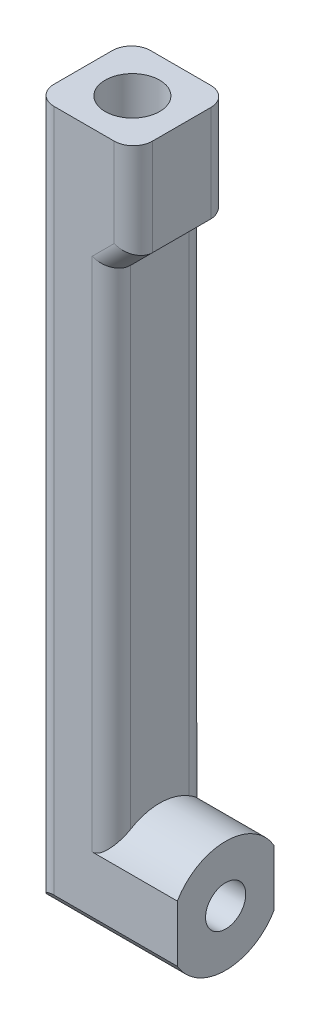
ISO-10303-21;
HEADER;
FILE_DESCRIPTION(('STEP AP214'),'2;1');
FILE_NAME('part.step','',(''),(''),'','','');
FILE_SCHEMA(('AUTOMOTIVE_DESIGN { 1 0 10303 214 1 1 1 1 }'));
ENDSEC;
DATA;
#1=APPLICATION_CONTEXT('core data for automotive mechanical design processes');
#2=APPLICATION_PROTOCOL_DEFINITION('international standard','automotive_design',2000,#1);
#3=PRODUCT_CONTEXT('',#1,'mechanical');
#4=PRODUCT('Part','Part','',(#3));
#5=PRODUCT_RELATED_PRODUCT_CATEGORY('part','',(#4));
#6=PRODUCT_DEFINITION_FORMATION('','',#4);
#7=PRODUCT_DEFINITION_CONTEXT('part definition',#1,'design');
#8=PRODUCT_DEFINITION('design','',#6,#7);
#9=PRODUCT_DEFINITION_SHAPE('','',#8);
#10=(LENGTH_UNIT() NAMED_UNIT(*) SI_UNIT(.MILLI.,.METRE.));
#11=(NAMED_UNIT(*) PLANE_ANGLE_UNIT() SI_UNIT($,.RADIAN.));
#12=(NAMED_UNIT(*) SI_UNIT($,.STERADIAN.) SOLID_ANGLE_UNIT());
#13=UNCERTAINTY_MEASURE_WITH_UNIT(LENGTH_MEASURE(1.E-05),#10,'distance_accuracy_value','');
#14=(GEOMETRIC_REPRESENTATION_CONTEXT(3) GLOBAL_UNCERTAINTY_ASSIGNED_CONTEXT((#13)) GLOBAL_UNIT_ASSIGNED_CONTEXT((#10,
#11,#12)) REPRESENTATION_CONTEXT('',''));
#15=CARTESIAN_POINT('',(0.,0.,0.));
#16=DIRECTION('',(0.,0.,1.));
#17=DIRECTION('',(1.,0.,0.));
#18=AXIS2_PLACEMENT_3D('',#15,#16,#17);
#19=CARTESIAN_POINT('',(-93.4999999999975,61.1827176402898,5.05));
#20=DIRECTION('',(-1.,0.,0.));
#21=DIRECTION('',(0.,0.,1.));
#22=AXIS2_PLACEMENT_3D('',#19,#20,#21);
#23=PLANE('',#22);
#24=CARTESIAN_POINT('',(-93.4999999999975,55.3327176402898,1.11022302462516E-13));
#25=DIRECTION('',(-1.,0.,0.));
#26=DIRECTION('',(0.,0.,1.));
#27=AXIS2_PLACEMENT_3D('',#24,#25,#26);
#28=CIRCLE('',#27,2.1);
#29=CARTESIAN_POINT('',(-93.4999999999975,55.3327176402898,2.10000000000011));
#30=VERTEX_POINT('',#29);
#31=EDGE_CURVE('E176',#30,#30,#28,.T.);
#32=ORIENTED_EDGE('',*,*,#31,.T.);
#33=EDGE_LOOP('',(#32));
#34=FACE_BOUND('',#33,.T.);
#35=CARTESIAN_POINT('',(-93.4999999999975,55.3327176402898,1.11022302462516E-13));
#36=DIRECTION('',(-1.,0.,0.));
#37=DIRECTION('',(0.,0.,1.));
#38=AXIS2_PLACEMENT_3D('',#35,#36,#37);
#39=CIRCLE('',#38,5.85);
#40=CARTESIAN_POINT('',(-93.4999999999975,58.2856822523363,-5.05));
#41=VERTEX_POINT('',#40);
#42=CARTESIAN_POINT('',(-93.4999999999975,58.2856822523367,5.05));
#43=VERTEX_POINT('',#42);
#44=EDGE_CURVE('E139',#41,#43,#39,.F.);
#45=ORIENTED_EDGE('',*,*,#44,.T.);
#46=DIRECTION('',(0.,1.,0.));
#47=VECTOR('',#46,1.);
#48=CARTESIAN_POINT('',(-93.4999999999975,61.1827176402898,5.05));
#49=LINE('',#48,#47);
#50=CARTESIAN_POINT('',(-93.4999999999975,52.379753028243,5.05));
#51=VERTEX_POINT('',#50);
#52=EDGE_CURVE('E142',#51,#43,#49,.T.);
#53=ORIENTED_EDGE('',*,*,#52,.F.);
#54=CARTESIAN_POINT('',(-93.4999999999975,55.3327176402898,1.11022302462516E-13));
#55=DIRECTION('',(-1.,0.,0.));
#56=DIRECTION('',(0.,0.,1.));
#57=AXIS2_PLACEMENT_3D('',#54,#55,#56);
#58=CIRCLE('',#57,5.85);
#59=CARTESIAN_POINT('',(-93.4999999999975,52.3797530282433,-5.05));
#60=VERTEX_POINT('',#59);
#61=EDGE_CURVE('E340',#60,#51,#58,.T.);
#62=ORIENTED_EDGE('',*,*,#61,.F.);
#63=DIRECTION('',(0.,1.,0.));
#64=VECTOR('',#63,1.);
#65=CARTESIAN_POINT('',(-93.4999999999975,61.1827176402898,-5.05));
#66=LINE('',#65,#64);
#67=EDGE_CURVE('E144',#60,#41,#66,.T.);
#68=ORIENTED_EDGE('',*,*,#67,.T.);
#69=EDGE_LOOP('',(#45,#53,#62,#68));
#70=FACE_BOUND('',#69,.T.);
#71=ADVANCED_FACE('F33',(#34,#70),#23,.F.);
#72=CARTESIAN_POINT('',(-108.4,49.4827176402898,5.05));
#73=DIRECTION('',(1.,0.,0.));
#74=DIRECTION('',(0.,0.,-1.));
#75=AXIS2_PLACEMENT_3D('',#72,#73,#74);
#76=PLANE('',#75);
#77=CARTESIAN_POINT('',(-108.4,55.3327176402898,1.11022302462516E-13));
#78=DIRECTION('',(-1.,0.,0.));
#79=DIRECTION('',(0.,0.,1.));
#80=AXIS2_PLACEMENT_3D('',#77,#78,#79);
#81=CIRCLE('',#80,2.1);
#82=CARTESIAN_POINT('',(-108.4,55.3327176402898,2.10000000000011));
#83=VERTEX_POINT('',#82);
#84=EDGE_CURVE('E173',#83,#83,#81,.T.);
#85=ORIENTED_EDGE('',*,*,#84,.F.);
#86=EDGE_LOOP('',(#85));
#87=FACE_BOUND('',#86,.T.);
#88=DIRECTION('',(0.,0.,-1.));
#89=VECTOR('',#88,1.);
#90=CARTESIAN_POINT('',(-108.4,123.789571889782,5.05));
#91=LINE('',#90,#89);
#92=CARTESIAN_POINT('',(-108.4,123.789571889782,3.05));
#93=VERTEX_POINT('',#92);
#94=CARTESIAN_POINT('',(-108.4,123.789571889782,-3.05));
#95=VERTEX_POINT('',#94);
#96=EDGE_CURVE('E168',#93,#95,#91,.T.);
#97=ORIENTED_EDGE('',*,*,#96,.T.);
#98=DIRECTION('',(0.,-1.,0.));
#99=VECTOR('',#98,1.);
#100=CARTESIAN_POINT('',(-108.4,52.3797530282433,-3.05));
#101=LINE('',#100,#99);
#102=CARTESIAN_POINT('',(-108.4,50.3407240505504,-3.05));
#103=VERTEX_POINT('',#102);
#104=EDGE_CURVE('E213',#95,#103,#101,.T.);
#105=ORIENTED_EDGE('',*,*,#104,.T.);
#106=CARTESIAN_POINT('',(-108.4,55.3327176402898,1.11022302462516E-13));
#107=DIRECTION('',(-1.,0.,0.));
#108=DIRECTION('',(0.,0.,1.));
#109=AXIS2_PLACEMENT_3D('',#106,#107,#108);
#110=CIRCLE('',#109,5.85);
#111=CARTESIAN_POINT('',(-108.4,50.3407240505503,3.05));
#112=VERTEX_POINT('',#111);
#113=EDGE_CURVE('E337',#103,#112,#110,.T.);
#114=ORIENTED_EDGE('',*,*,#113,.T.);
#115=DIRECTION('',(0.,-1.,0.));
#116=VECTOR('',#115,1.);
#117=CARTESIAN_POINT('',(-108.4,49.4827176402898,3.05));
#118=LINE('',#117,#116);
#119=EDGE_CURVE('E211',#112,#93,#118,.F.);
#120=ORIENTED_EDGE('',*,*,#119,.T.);
#121=EDGE_LOOP('',(#97,#105,#114,#120));
#122=FACE_BOUND('',#121,.T.);
#123=ADVANCED_FACE('F260',(#87,#122),#76,.F.);
#124=CARTESIAN_POINT('',(0.,0.,-5.05));
#125=DIRECTION('',(0.,0.,-1.));
#126=DIRECTION('',(-1.,0.,0.));
#127=AXIS2_PLACEMENT_3D('',#124,#125,#126);
#128=PLANE('',#127);
#129=DIRECTION('',(-1.,0.,0.));
#130=VECTOR('',#129,1.);
#131=CARTESIAN_POINT('',(-93.4999999999975,52.3797530282433,-5.05));
#132=LINE('',#131,#130);
#133=CARTESIAN_POINT('',(-106.4,52.3797530282433,-5.05));
#134=VERTEX_POINT('',#133);
#135=EDGE_CURVE('E147',#60,#134,#132,.T.);
#136=ORIENTED_EDGE('',*,*,#135,.T.);
#137=DIRECTION('',(0.,-1.,0.));
#138=VECTOR('',#137,1.);
#139=CARTESIAN_POINT('',(-106.4,123.789571889782,-5.05));
#140=LINE('',#139,#138);
#141=CARTESIAN_POINT('',(-106.4,123.789571889782,-5.05));
#142=VERTEX_POINT('',#141);
#143=EDGE_CURVE('E196',#134,#142,#140,.F.);
#144=ORIENTED_EDGE('',*,*,#143,.T.);
#145=DIRECTION('',(-1.,0.,0.));
#146=VECTOR('',#145,1.);
#147=CARTESIAN_POINT('',(-108.4,123.789571889782,-5.05));
#148=LINE('',#147,#146);
#149=CARTESIAN_POINT('',(-100.1,123.789571889782,-5.05));
#150=VERTEX_POINT('',#149);
#151=EDGE_CURVE('E166',#150,#142,#148,.T.);
#152=ORIENTED_EDGE('',*,*,#151,.F.);
#153=DIRECTION('',(0.,1.,0.));
#154=VECTOR('',#153,1.);
#155=CARTESIAN_POINT('',(-100.1,113.689571889782,-5.05));
#156=LINE('',#155,#154);
#157=CARTESIAN_POINT('',(-100.1,114.517999014529,-5.05));
#158=VERTEX_POINT('',#157);
#159=EDGE_CURVE('E189',#150,#158,#156,.F.);
#160=ORIENTED_EDGE('',*,*,#159,.T.);
#161=DIRECTION('',(0.707106781186548,0.707106781186548,0.));
#162=VECTOR('',#161,1.);
#163=CARTESIAN_POINT('',(-107.308999507264,107.308999507264,-5.05));
#164=LINE('',#163,#162);
#165=CARTESIAN_POINT('',(-102.4,112.217999014529,-5.05));
#166=VERTEX_POINT('',#165);
#167=EDGE_CURVE('E191',#158,#166,#164,.F.);
#168=ORIENTED_EDGE('',*,*,#167,.T.);
#169=DIRECTION('',(0.,1.,0.));
#170=VECTOR('',#169,1.);
#171=CARTESIAN_POINT('',(-102.4,58.2856822523363,-5.05));
#172=LINE('',#171,#170);
#173=CARTESIAN_POINT('',(-102.4,58.2856822523363,-5.05));
#174=VERTEX_POINT('',#173);
#175=EDGE_CURVE('E193',#166,#174,#172,.F.);
#176=ORIENTED_EDGE('',*,*,#175,.T.);
#177=DIRECTION('',(-1.,0.,0.));
#178=VECTOR('',#177,1.);
#179=CARTESIAN_POINT('',(-87.678031772752,58.2856822523363,-5.05));
#180=LINE('',#179,#178);
#181=EDGE_CURVE('E148',#41,#174,#180,.T.);
#182=ORIENTED_EDGE('',*,*,#181,.F.);
#183=ORIENTED_EDGE('',*,*,#67,.F.);
#184=EDGE_LOOP('',(#136,#144,#152,#160,#168,#176,#182,#183));
#185=FACE_BOUND('',#184,.T.);
#186=ADVANCED_FACE('F257',(#185),#128,.T.);
#187=CARTESIAN_POINT('',(0.,0.,5.05));
#188=DIRECTION('',(0.,0.,-1.));
#189=DIRECTION('',(-1.,0.,0.));
#190=AXIS2_PLACEMENT_3D('',#187,#188,#189);
#191=PLANE('',#190);
#192=DIRECTION('',(-1.,0.,0.));
#193=VECTOR('',#192,1.);
#194=CARTESIAN_POINT('',(-108.4,123.789571889782,5.05));
#195=LINE('',#194,#193);
#196=CARTESIAN_POINT('',(-100.1,123.789571889782,5.05));
#197=VERTEX_POINT('',#196);
#198=CARTESIAN_POINT('',(-106.4,123.789571889782,5.05));
#199=VERTEX_POINT('',#198);
#200=EDGE_CURVE('E165',#197,#199,#195,.T.);
#201=ORIENTED_EDGE('',*,*,#200,.T.);
#202=DIRECTION('',(0.,-1.,0.));
#203=VECTOR('',#202,1.);
#204=CARTESIAN_POINT('',(-106.4,0.,5.05));
#205=LINE('',#204,#203);
#206=CARTESIAN_POINT('',(-106.4,52.379753028243,5.05));
#207=VERTEX_POINT('',#206);
#208=EDGE_CURVE('E205',#199,#207,#205,.T.);
#209=ORIENTED_EDGE('',*,*,#208,.T.);
#210=DIRECTION('',(-1.,0.,0.));
#211=VECTOR('',#210,1.);
#212=CARTESIAN_POINT('',(-93.4999999999975,52.379753028243,5.05));
#213=LINE('',#212,#211);
#214=EDGE_CURVE('E164',#51,#207,#213,.T.);
#215=ORIENTED_EDGE('',*,*,#214,.F.);
#216=ORIENTED_EDGE('',*,*,#52,.T.);
#217=DIRECTION('',(-1.,0.,0.));
#218=VECTOR('',#217,1.);
#219=CARTESIAN_POINT('',(-87.678031772752,58.2856822523367,5.05));
#220=LINE('',#219,#218);
#221=CARTESIAN_POINT('',(-102.4,58.2856822523367,5.05));
#222=VERTEX_POINT('',#221);
#223=EDGE_CURVE('E150',#43,#222,#220,.T.);
#224=ORIENTED_EDGE('',*,*,#223,.T.);
#225=DIRECTION('',(0.,1.,0.));
#226=VECTOR('',#225,1.);
#227=CARTESIAN_POINT('',(-102.4,0.,5.05));
#228=LINE('',#227,#226);
#229=CARTESIAN_POINT('',(-102.4,112.217999014529,5.05));
#230=VERTEX_POINT('',#229);
#231=EDGE_CURVE('E203',#222,#230,#228,.T.);
#232=ORIENTED_EDGE('',*,*,#231,.T.);
#233=DIRECTION('',(0.707106781186548,0.707106781186548,0.));
#234=VECTOR('',#233,1.);
#235=CARTESIAN_POINT('',(-99.514213562373,115.103785452156,5.05));
#236=LINE('',#235,#234);
#237=CARTESIAN_POINT('',(-100.1,114.517999014529,5.05));
#238=VERTEX_POINT('',#237);
#239=EDGE_CURVE('E200',#230,#238,#236,.T.);
#240=ORIENTED_EDGE('',*,*,#239,.T.);
#241=DIRECTION('',(0.,1.,0.));
#242=VECTOR('',#241,1.);
#243=CARTESIAN_POINT('',(-100.1,-1.37541243521012E-13,5.05));
#244=LINE('',#243,#242);
#245=EDGE_CURVE('E198',#238,#197,#244,.T.);
#246=ORIENTED_EDGE('',*,*,#245,.T.);
#247=EDGE_LOOP('',(#201,#209,#215,#216,#224,#232,#240,#246));
#248=FACE_BOUND('',#247,.T.);
#249=ADVANCED_FACE('F161',(#248),#191,.F.);
#250=CARTESIAN_POINT('',(-100.4,113.689571889782,5.05));
#251=DIRECTION('',(-1.,0.,0.));
#252=DIRECTION('',(0.,0.,1.));
#253=AXIS2_PLACEMENT_3D('',#250,#251,#252);
#254=PLANE('',#253);
#255=CARTESIAN_POINT('',(-100.4,55.3327176402898,1.11022302462516E-13));
#256=DIRECTION('',(-1.,0.,0.));
#257=DIRECTION('',(0.,0.,1.));
#258=AXIS2_PLACEMENT_3D('',#255,#256,#257);
#259=CIRCLE('',#258,5.85);
#260=CARTESIAN_POINT('',(-100.4,60.3247112300294,3.05));
#261=VERTEX_POINT('',#260);
#262=CARTESIAN_POINT('',(-100.4,60.3247112300293,-3.05));
#263=VERTEX_POINT('',#262);
#264=EDGE_CURVE('E156',#261,#263,#259,.T.);
#265=ORIENTED_EDGE('',*,*,#264,.T.);
#266=DIRECTION('',(0.,1.,0.));
#267=VECTOR('',#266,1.);
#268=CARTESIAN_POINT('',(-100.4,111.389571889783,-3.05));
#269=LINE('',#268,#267);
#270=CARTESIAN_POINT('',(-100.4,111.389571889782,-3.05));
#271=VERTEX_POINT('',#270);
#272=EDGE_CURVE('E209',#263,#271,#269,.T.);
#273=ORIENTED_EDGE('',*,*,#272,.T.);
#274=DIRECTION('',(0.,0.,1.));
#275=VECTOR('',#274,1.);
#276=CARTESIAN_POINT('',(-100.4,111.389571889782,-8.30269119345807));
#277=LINE('',#276,#275);
#278=CARTESIAN_POINT('',(-100.4,111.389571889782,3.05));
#279=VERTEX_POINT('',#278);
#280=EDGE_CURVE('E346',#271,#279,#277,.T.);
#281=ORIENTED_EDGE('',*,*,#280,.T.);
#282=DIRECTION('',(0.,1.,0.));
#283=VECTOR('',#282,1.);
#284=CARTESIAN_POINT('',(-100.4,113.689571889782,3.05));
#285=LINE('',#284,#283);
#286=EDGE_CURVE('E207',#279,#261,#285,.F.);
#287=ORIENTED_EDGE('',*,*,#286,.T.);
#288=EDGE_LOOP('',(#265,#273,#281,#287));
#289=FACE_BOUND('',#288,.T.);
#290=ADVANCED_FACE('F256',(#289),#254,.F.);
#291=CARTESIAN_POINT('',(-98.1,123.789571889782,5.05));
#292=DIRECTION('',(-1.,0.,0.));
#293=DIRECTION('',(0.,-1.,0.));
#294=AXIS2_PLACEMENT_3D('',#291,#292,#293);
#295=PLANE('',#294);
#296=DIRECTION('',(0.,0.,-1.));
#297=VECTOR('',#296,1.);
#298=CARTESIAN_POINT('',(-98.0999999999999,113.689571889782,5.05));
#299=LINE('',#298,#297);
#300=CARTESIAN_POINT('',(-98.0999999999999,113.689571889782,3.05));
#301=VERTEX_POINT('',#300);
#302=CARTESIAN_POINT('',(-98.0999999999999,113.689571889782,-3.05));
#303=VERTEX_POINT('',#302);
#304=EDGE_CURVE('E182',#301,#303,#299,.T.);
#305=ORIENTED_EDGE('',*,*,#304,.T.);
#306=DIRECTION('',(0.,1.,0.));
#307=VECTOR('',#306,1.);
#308=CARTESIAN_POINT('',(-98.1,123.789571889782,-3.05));
#309=LINE('',#308,#307);
#310=CARTESIAN_POINT('',(-98.1,123.789571889782,-3.05));
#311=VERTEX_POINT('',#310);
#312=EDGE_CURVE('E51',#303,#311,#309,.T.);
#313=ORIENTED_EDGE('',*,*,#312,.T.);
#314=DIRECTION('',(0.,0.,-1.));
#315=VECTOR('',#314,1.);
#316=CARTESIAN_POINT('',(-98.1,123.789571889782,5.05));
#317=LINE('',#316,#315);
#318=CARTESIAN_POINT('',(-98.1,123.789571889782,3.05));
#319=VERTEX_POINT('',#318);
#320=EDGE_CURVE('E180',#319,#311,#317,.T.);
#321=ORIENTED_EDGE('',*,*,#320,.F.);
#322=DIRECTION('',(0.,1.,0.));
#323=VECTOR('',#322,1.);
#324=CARTESIAN_POINT('',(-98.1,123.789571889782,3.05));
#325=LINE('',#324,#323);
#326=EDGE_CURVE('E327',#319,#301,#325,.F.);
#327=ORIENTED_EDGE('',*,*,#326,.T.);
#328=EDGE_LOOP('',(#305,#313,#321,#327));
#329=FACE_BOUND('',#328,.T.);
#330=ADVANCED_FACE('F264',(#329),#295,.F.);
#331=CARTESIAN_POINT('',(-108.4,123.789571889782,5.05));
#332=DIRECTION('',(0.,-1.,0.));
#333=DIRECTION('',(0.,0.,-1.));
#334=AXIS2_PLACEMENT_3D('',#331,#332,#333);
#335=PLANE('',#334);
#336=CARTESIAN_POINT('',(-103.25,123.789571889782,0.));
#337=DIRECTION('',(0.,1.,0.));
#338=DIRECTION('',(0.,0.,1.));
#339=AXIS2_PLACEMENT_3D('',#336,#337,#338);
#340=CIRCLE('',#339,2.85);
#341=CARTESIAN_POINT('',(-103.25,123.789571889782,2.85));
#342=VERTEX_POINT('',#341);
#343=EDGE_CURVE('E349',#342,#342,#340,.T.);
#344=ORIENTED_EDGE('',*,*,#343,.F.);
#345=EDGE_LOOP('',(#344));
#346=FACE_BOUND('',#345,.T.);
#347=ORIENTED_EDGE('',*,*,#151,.T.);
#348=CARTESIAN_POINT('',(-106.4,123.789571889782,-3.05));
#349=DIRECTION('',(0.,-1.,0.));
#350=DIRECTION('',(0.,0.,-1.));
#351=AXIS2_PLACEMENT_3D('',#348,#349,#350);
#352=CIRCLE('',#351,2.);
#353=EDGE_CURVE('E325',#142,#95,#352,.F.);
#354=ORIENTED_EDGE('',*,*,#353,.T.);
#355=ORIENTED_EDGE('',*,*,#96,.F.);
#356=CARTESIAN_POINT('',(-106.4,123.789571889782,3.05));
#357=DIRECTION('',(0.,-1.,0.));
#358=DIRECTION('',(0.,0.,-1.));
#359=AXIS2_PLACEMENT_3D('',#356,#357,#358);
#360=CIRCLE('',#359,2.);
#361=EDGE_CURVE('E330',#93,#199,#360,.F.);
#362=ORIENTED_EDGE('',*,*,#361,.T.);
#363=ORIENTED_EDGE('',*,*,#200,.F.);
#364=CARTESIAN_POINT('',(-100.1,123.789571889782,3.05));
#365=DIRECTION('',(0.,-1.,0.));
#366=DIRECTION('',(0.,0.,-1.));
#367=AXIS2_PLACEMENT_3D('',#364,#365,#366);
#368=CIRCLE('',#367,2.);
#369=EDGE_CURVE('E58',#197,#319,#368,.F.);
#370=ORIENTED_EDGE('',*,*,#369,.T.);
#371=ORIENTED_EDGE('',*,*,#320,.T.);
#372=CARTESIAN_POINT('',(-100.1,123.789571889782,-3.05));
#373=DIRECTION('',(0.,-1.,0.));
#374=DIRECTION('',(0.,0.,-1.));
#375=AXIS2_PLACEMENT_3D('',#372,#373,#374);
#376=CIRCLE('',#375,2.);
#377=EDGE_CURVE('E328',#311,#150,#376,.F.);
#378=ORIENTED_EDGE('',*,*,#377,.T.);
#379=EDGE_LOOP('',(#347,#354,#355,#362,#363,#370,#371,#378));
#380=FACE_BOUND('',#379,.T.);
#381=ADVANCED_FACE('F252',(#346,#380),#335,.F.);
#382=CARTESIAN_POINT('',(-93.4999999999975,55.3327176402898,1.11022302462516E-13));
#383=DIRECTION('',(-1.,0.,0.));
#384=DIRECTION('',(0.,0.,1.));
#385=AXIS2_PLACEMENT_3D('',#382,#383,#384);
#386=CYLINDRICAL_SURFACE('',#385,2.1);
#387=ORIENTED_EDGE('',*,*,#31,.F.);
#388=EDGE_LOOP('',(#387));
#389=FACE_BOUND('',#388,.T.);
#390=ORIENTED_EDGE('',*,*,#84,.T.);
#391=EDGE_LOOP('',(#390));
#392=FACE_BOUND('',#391,.T.);
#393=ADVANCED_FACE('F248',(#389,#392),#386,.F.);
#394=CARTESIAN_POINT('',(-103.25,114.289571889782,0.));
#395=DIRECTION('',(0.,1.,0.));
#396=DIRECTION('',(0.,0.,1.));
#397=AXIS2_PLACEMENT_3D('',#394,#395,#396);
#398=CYLINDRICAL_SURFACE('',#397,2.85);
#399=CARTESIAN_POINT('',(-103.25,114.289571889782,0.));
#400=DIRECTION('',(0.,1.,0.));
#401=DIRECTION('',(0.,0.,1.));
#402=AXIS2_PLACEMENT_3D('',#399,#400,#401);
#403=CIRCLE('',#402,2.85);
#404=CARTESIAN_POINT('',(-103.25,114.289571889782,2.85));
#405=VERTEX_POINT('',#404);
#406=EDGE_CURVE('E350',#405,#405,#403,.T.);
#407=ORIENTED_EDGE('',*,*,#406,.F.);
#408=EDGE_LOOP('',(#407));
#409=FACE_BOUND('',#408,.T.);
#410=ORIENTED_EDGE('',*,*,#343,.T.);
#411=EDGE_LOOP('',(#410));
#412=FACE_BOUND('',#411,.T.);
#413=ADVANCED_FACE('F244',(#409,#412),#398,.F.);
#414=CARTESIAN_POINT('',(-103.25,114.289571889782,0.));
#415=DIRECTION('',(0.,1.,0.));
#416=DIRECTION('',(0.,0.,1.));
#417=AXIS2_PLACEMENT_3D('',#414,#415,#416);
#418=PLANE('',#417);
#419=ORIENTED_EDGE('',*,*,#406,.T.);
#420=EDGE_LOOP('',(#419));
#421=FACE_BOUND('',#420,.T.);
#422=ADVANCED_FACE('F240',(#421),#418,.T.);
#423=CARTESIAN_POINT('',(-98.0999999999999,113.689571889782,-8.30269119345807));
#424=DIRECTION('',(0.707106781186547,-0.707106781186547,0.));
#425=DIRECTION('',(0.707106781186548,0.707106781186548,0.));
#426=AXIS2_PLACEMENT_3D('',#423,#424,#425);
#427=PLANE('',#426);
#428=ORIENTED_EDGE('',*,*,#280,.F.);
#429=DIRECTION('',(0.707106781186548,0.707106781186548,0.));
#430=VECTOR('',#429,1.);
#431=CARTESIAN_POINT('',(-98.0999999999999,113.689571889782,-3.05));
#432=LINE('',#431,#430);
#433=EDGE_CURVE('E186',#271,#303,#432,.T.);
#434=ORIENTED_EDGE('',*,*,#433,.T.);
#435=ORIENTED_EDGE('',*,*,#304,.F.);
#436=DIRECTION('',(0.707106781186548,0.707106781186548,0.));
#437=VECTOR('',#436,1.);
#438=CARTESIAN_POINT('',(-100.4,111.389571889783,3.05));
#439=LINE('',#438,#437);
#440=EDGE_CURVE('E184',#301,#279,#439,.F.);
#441=ORIENTED_EDGE('',*,*,#440,.T.);
#442=EDGE_LOOP('',(#428,#434,#435,#441));
#443=FACE_BOUND('',#442,.T.);
#444=ADVANCED_FACE('F234',(#443),#427,.T.);
#445=CARTESIAN_POINT('',(-93.4999999999975,55.3327176402898,1.11022302462516E-13));
#446=DIRECTION('',(-1.,0.,0.));
#447=DIRECTION('',(0.,0.,1.));
#448=AXIS2_PLACEMENT_3D('',#445,#446,#447);
#449=CYLINDRICAL_SURFACE('',#448,5.85);
#450=ORIENTED_EDGE('',*,*,#113,.F.);
#451=CARTESIAN_POINT('',(-108.4,50.3407240505504,-3.05));
#452=CARTESIAN_POINT('',(-108.399995761432,50.3854015720885,-3.12315906520652));
#453=CARTESIAN_POINT('',(-108.39598775132,50.4316841732602,-3.19526354427114));
#454=CARTESIAN_POINT('',(-108.380614204928,50.5269091302011,-3.33675138226539));
#455=CARTESIAN_POINT('',(-108.369258788623,50.5758477428938,-3.40613834497413));
#456=CARTESIAN_POINT('',(-108.339938115911,50.6756154292778,-3.54131653149033));
#457=CARTESIAN_POINT('',(-108.322018870548,50.7264291809347,-3.60712920874935));
#458=CARTESIAN_POINT('',(-108.280111152849,50.8297971537269,-3.73537120897361));
#459=CARTESIAN_POINT('',(-108.256120759691,50.8823519211121,-3.79779945354909));
#460=CARTESIAN_POINT('',(-108.179700987887,51.0341075736748,-3.97073321219546));
#461=CARTESIAN_POINT('',(-108.120453318217,51.1349115761807,-4.07689769862639));
#462=CARTESIAN_POINT('',(-107.984600640531,51.3381411884581,-4.27623758388349));
#463=CARTESIAN_POINT('',(-107.9079487194,51.4405704719946,-4.36937675584391));
#464=CARTESIAN_POINT('',(-107.745230292431,51.63419617615,-4.53410019034556));
#465=CARTESIAN_POINT('',(-107.660604005122,51.7255824447365,-4.60686403525083));
#466=CARTESIAN_POINT('',(-107.522324533212,51.8577260477742,-4.70637809443424));
#467=CARTESIAN_POINT('',(-107.474390585914,51.9009138721249,-4.7379195987968));
#468=CARTESIAN_POINT('',(-107.374394771275,51.9847910255763,-4.79755395818406));
#469=CARTESIAN_POINT('',(-107.322335753681,52.0254820456665,-4.82564916043349));
#470=CARTESIAN_POINT('',(-107.209812170781,52.105954464743,-4.87985808219955));
#471=CARTESIAN_POINT('',(-107.149013075734,52.1454650552532,-4.90568850490384));
#472=CARTESIAN_POINT('',(-107.021759690736,52.2180668721318,-4.95210101048938));
#473=CARTESIAN_POINT('',(-106.955310135821,52.2511633986253,-4.97268743110159));
#474=CARTESIAN_POINT('',(-106.828898571745,52.3029236771282,-5.00435892200756));
#475=CARTESIAN_POINT('',(-106.769826035949,52.3230978300776,-5.01647485856434));
#476=CARTESIAN_POINT('',(-106.648659997226,52.3549002685359,-5.03542028217605));
#477=CARTESIAN_POINT('',(-106.586576288335,52.3665545073855,-5.04226582729798));
#478=CARTESIAN_POINT('',(-106.503312120454,52.375374003432,-5.04743717129952));
#479=CARTESIAN_POINT('',(-106.482701702761,52.3770124059068,-5.04839656329437));
#480=CARTESIAN_POINT('',(-106.441397153472,52.3792019427527,-5.04967790737545));
#481=CARTESIAN_POINT('',(-106.420702997984,52.3797527411025,-5.04999966246032));
#482=CARTESIAN_POINT('',(-106.4,52.3797530282433,-5.05));
#483=B_SPLINE_CURVE_WITH_KNOTS('',3,(#451,#452,#453,#454,#455,#456,#457,#458,#459,#460,#461,
#462,#463,#464,#465,#466,#467,#468,#469,#470,#471,#472,#473,#474,#475,#476,#477,#478,#479,#480,
#481,#482),.UNSPECIFIED.,.F.,.F.,(4,2,2,2,2,2,2,2,2,2,2,2,2,2,2,4),(0.,0.256960456253268,
0.513567738398119,0.768409644237162,1.02333227938004,1.49538754399265,1.96873066444406,
2.40004565838513,2.61530807477418,2.83042305537287,3.0608466088059,3.29107893709455,
3.48116131034666,3.67066221459465,3.73272495522076,3.7948068674771),.UNSPECIFIED.);
#484=EDGE_CURVE('E223',#103,#134,#483,.T.);
#485=ORIENTED_EDGE('',*,*,#484,.T.);
#486=ORIENTED_EDGE('',*,*,#135,.F.);
#487=ORIENTED_EDGE('',*,*,#61,.T.);
#488=ORIENTED_EDGE('',*,*,#214,.T.);
#489=CARTESIAN_POINT('',(-106.4,52.379753028243,5.05));
#490=CARTESIAN_POINT('',(-106.431680261991,52.3797651703712,5.05000487525924));
#491=CARTESIAN_POINT('',(-106.46334142703,52.3784647433087,5.04924683404242));
#492=CARTESIAN_POINT('',(-106.526344879017,52.3733521338534,5.04625302444705));
#493=CARTESIAN_POINT('',(-106.557687563032,52.369543610222,5.0440194085926));
#494=CARTESIAN_POINT('',(-106.650088572709,52.354659402606,5.03525607419655));
#495=CARTESIAN_POINT('',(-106.71041599803,52.340118281639,5.02666083197371));
#496=CARTESIAN_POINT('',(-106.846181409789,52.2976745580488,5.00117861411285));
#497=CARTESIAN_POINT('',(-106.920391121596,52.2670055440596,4.98253234005837));
#498=CARTESIAN_POINT('',(-107.062623538554,52.1966052044831,4.93852468300627));
#499=CARTESIAN_POINT('',(-107.130603437169,52.1568169297844,4.91312093278673));
#500=CARTESIAN_POINT('',(-107.249819499894,52.0783749116495,4.86143966199125));
#501=CARTESIAN_POINT('',(-107.301986459809,52.0405762675898,4.83596627500238));
#502=CARTESIAN_POINT('',(-107.402318747303,51.9621670452293,4.78164963341238));
#503=CARTESIAN_POINT('',(-107.450481371811,51.9215546008765,4.75280413361427));
#504=CARTESIAN_POINT('',(-107.589576990069,51.7968201436288,4.66159696827063));
#505=CARTESIAN_POINT('',(-107.675010040778,51.7098768712169,4.59461327598581));
#506=CARTESIAN_POINT('',(-107.807878734839,51.5609494384883,4.47241363721481));
#507=CARTESIAN_POINT('',(-107.858845287869,51.4996565079035,4.42006205439291));
#508=CARTESIAN_POINT('',(-107.954627283575,51.3766719019837,4.3103339359715));
#509=CARTESIAN_POINT('',(-107.999440623861,51.3149800978654,4.2529556938088));
#510=CARTESIAN_POINT('',(-108.082641002698,51.1921993258252,4.13351325230171));
#511=CARTESIAN_POINT('',(-108.121044690758,51.1311091965439,4.07146182089026));
#512=CARTESIAN_POINT('',(-108.191219717678,51.0100501361182,3.9426956249204));
#513=CARTESIAN_POINT('',(-108.222992543012,50.9500809564353,3.87598191001549));
#514=CARTESIAN_POINT('',(-108.274660533683,50.8417899319896,3.74963835509735));
#515=CARTESIAN_POINT('',(-108.295653364352,50.793196850745,3.6906886022725));
#516=CARTESIAN_POINT('',(-108.33226985673,50.6976204010444,3.56991633297677));
#517=CARTESIAN_POINT('',(-108.3478957673,50.6506363658096,3.5080950321079));
#518=CARTESIAN_POINT('',(-108.373388496631,50.5584320608572,3.38154399485653));
#519=CARTESIAN_POINT('',(-108.383229299799,50.5132205992342,3.31680250889732));
#520=CARTESIAN_POINT('',(-108.396537891937,50.4251165956886,3.18500977360785));
#521=CARTESIAN_POINT('',(-108.39999741631,50.3822271306992,3.11795564336783));
#522=CARTESIAN_POINT('',(-108.4,50.3407240505503,3.05));
#523=B_SPLINE_CURVE_WITH_KNOTS('',3,(#489,#490,#491,#492,#493,#494,#495,#496,#497,#498,#499,
#500,#501,#502,#503,#504,#505,#506,#507,#508,#509,#510,#511,#512,#513,#514,#515,#516,#517,#518,
#519,#520,#521,#522),.UNSPECIFIED.,.F.,.F.,(4,2,2,2,2,2,2,2,2,2,2,2,2,2,2,2,4),(0.,
0.0949707275354055,0.189803219636718,0.376820299258323,0.622765010960293,0.87028962790205,
1.07782722385142,1.28550379661712,1.70127378431799,1.98711001442778,2.27304366552562,
2.55822261784775,2.84333757133639,3.08079117253265,3.31814515351994,3.55655850661182,
3.79528042016273),.UNSPECIFIED.);
#524=EDGE_CURVE('E216',#207,#112,#523,.T.);
#525=ORIENTED_EDGE('',*,*,#524,.T.);
#526=EDGE_LOOP('',(#450,#485,#486,#487,#488,#525));
#527=FACE_BOUND('',#526,.T.);
#528=ADVANCED_FACE('F229',(#527),#449,.T.);
#529=CARTESIAN_POINT('',(-87.678031772752,55.3327176402898,1.11022302462516E-13));
#530=DIRECTION('',(-1.,0.,0.));
#531=DIRECTION('',(0.,0.,1.));
#532=AXIS2_PLACEMENT_3D('',#529,#530,#531);
#533=CYLINDRICAL_SURFACE('',#532,5.85);
#534=ORIENTED_EDGE('',*,*,#181,.T.);
#535=CARTESIAN_POINT('',(-102.4,58.2856822523363,-5.05));
#536=CARTESIAN_POINT('',(-102.368319738009,58.2856701102081,-5.05000487525924));
#537=CARTESIAN_POINT('',(-102.33665857297,58.2869705372706,-5.04924683404242));
#538=CARTESIAN_POINT('',(-102.273655120983,58.2920831467259,-5.04625302444705));
#539=CARTESIAN_POINT('',(-102.242312436968,58.2958916703573,-5.0440194085926));
#540=CARTESIAN_POINT('',(-102.149911427291,58.3107758779733,-5.03525607419655));
#541=CARTESIAN_POINT('',(-102.08958400197,58.3253169989403,-5.02666083197371));
#542=CARTESIAN_POINT('',(-101.953818590211,58.3677607225305,-5.00117861411286));
#543=CARTESIAN_POINT('',(-101.879608878404,58.3984297365197,-4.98253234005838));
#544=CARTESIAN_POINT('',(-101.737376461446,58.4688300760961,-4.93852468300629));
#545=CARTESIAN_POINT('',(-101.669396562831,58.5086183507949,-4.91312093278675));
#546=CARTESIAN_POINT('',(-101.550180500105,58.5870603689298,-4.86143966199128));
#547=CARTESIAN_POINT('',(-101.498013540191,58.6248590129895,-4.83596627500242));
#548=CARTESIAN_POINT('',(-101.397681252697,58.7032682353501,-4.78164963341242));
#549=CARTESIAN_POINT('',(-101.349518628189,58.7438806797028,-4.75280413361431));
#550=CARTESIAN_POINT('',(-101.210423009931,58.8686151369505,-4.66159696827068));
#551=CARTESIAN_POINT('',(-101.124989959222,58.9555584093624,-4.59461327598587));
#552=CARTESIAN_POINT('',(-100.99212126516,59.1044858420911,-4.47241363721488));
#553=CARTESIAN_POINT('',(-100.941154712131,59.1657787726759,-4.42006205439298));
#554=CARTESIAN_POINT('',(-100.845372716425,59.2887633785956,-4.31033393597157));
#555=CARTESIAN_POINT('',(-100.800559376138,59.350455182714,-4.25295569380887));
#556=CARTESIAN_POINT('',(-100.717358997302,59.4732359547542,-4.13351325230177));
#557=CARTESIAN_POINT('',(-100.678955309242,59.5343260840355,-4.07146182089032));
#558=CARTESIAN_POINT('',(-100.608780282321,59.6553851444612,-3.94269562492046));
#559=CARTESIAN_POINT('',(-100.577007456988,59.7153543241441,-3.87598191001555));
#560=CARTESIAN_POINT('',(-100.525339466317,59.8236453485899,-3.74963835509741));
#561=CARTESIAN_POINT('',(-100.504346635648,59.8722384298344,-3.69068860227254));
#562=CARTESIAN_POINT('',(-100.46773014327,59.9678148795351,-3.56991633297681));
#563=CARTESIAN_POINT('',(-100.4521042327,60.0147989147699,-3.50809503210794));
#564=CARTESIAN_POINT('',(-100.426611503369,60.1070032197223,-3.38154399485656));
#565=CARTESIAN_POINT('',(-100.416770700201,60.1522146813453,-3.31680250889734));
#566=CARTESIAN_POINT('',(-100.403462108063,60.2403186848909,-3.18500977360786));
#567=CARTESIAN_POINT('',(-100.400002583689,60.2832081498803,-3.11795564336784));
#568=CARTESIAN_POINT('',(-100.4,60.3247112300293,-3.05));
#569=B_SPLINE_CURVE_WITH_KNOTS('',3,(#535,#536,#537,#538,#539,#540,#541,#542,#543,#544,#545,
#546,#547,#548,#549,#550,#551,#552,#553,#554,#555,#556,#557,#558,#559,#560,#561,#562,#563,#564,
#565,#566,#567,#568),.UNSPECIFIED.,.F.,.F.,(4,2,2,2,2,2,2,2,2,2,2,2,2,2,2,2,4),(0.,
0.0949707275354055,0.189803219636704,0.376820299258282,0.622765010960237,0.870289627901978,
1.07782722385137,1.28550379661705,1.70127378431792,1.98711001442772,2.27304366552561,
2.55822261784777,2.84333757133643,3.08079117253271,3.31814515352003,3.55655850661194,
3.79528042016287),.UNSPECIFIED.);
#570=EDGE_CURVE('E43',#174,#263,#569,.T.);
#571=ORIENTED_EDGE('',*,*,#570,.T.);
#572=ORIENTED_EDGE('',*,*,#264,.F.);
#573=CARTESIAN_POINT('',(-100.4,60.3247112300294,3.05));
#574=CARTESIAN_POINT('',(-100.400004238568,60.2800337084913,3.12315906520652));
#575=CARTESIAN_POINT('',(-100.40401224868,60.2337511073196,3.19526354427115));
#576=CARTESIAN_POINT('',(-100.419385795072,60.1385261503787,3.3367513822654));
#577=CARTESIAN_POINT('',(-100.430741211377,60.089587537686,3.40613834497414));
#578=CARTESIAN_POINT('',(-100.460061884089,59.989819851302,3.54131653149034));
#579=CARTESIAN_POINT('',(-100.477981129452,59.9390060996451,3.60712920874937));
#580=CARTESIAN_POINT('',(-100.51988884715,59.835638126853,3.73537120897363));
#581=CARTESIAN_POINT('',(-100.543879240309,59.7830833594677,3.79779945354911));
#582=CARTESIAN_POINT('',(-100.620299012113,59.631327706905,3.97073321219548));
#583=CARTESIAN_POINT('',(-100.679546681782,59.5305237043991,4.07689769862642));
#584=CARTESIAN_POINT('',(-100.815399359469,59.3272940921218,4.27623758388351));
#585=CARTESIAN_POINT('',(-100.8920512806,59.2248648085853,4.36937675584393));
#586=CARTESIAN_POINT('',(-101.054769707569,59.03123910443,4.53410019034557));
#587=CARTESIAN_POINT('',(-101.139395994877,58.9398528358435,4.60686403525084));
#588=CARTESIAN_POINT('',(-101.277675466788,58.8077092328058,4.70637809443425));
#589=CARTESIAN_POINT('',(-101.325609414085,58.7645214084551,4.7379195987968));
#590=CARTESIAN_POINT('',(-101.425605228725,58.6806442550037,4.79755395818407));
#591=CARTESIAN_POINT('',(-101.477664246319,58.6399532349135,4.82564916043349));
#592=CARTESIAN_POINT('',(-101.590187829218,58.559480815837,4.87985808219955));
#593=CARTESIAN_POINT('',(-101.650986924266,58.5199702253268,4.90568850490384));
#594=CARTESIAN_POINT('',(-101.778240309264,58.4473684084483,4.95210101048939));
#595=CARTESIAN_POINT('',(-101.844689864178,58.4142718819547,4.9726874311016));
#596=CARTESIAN_POINT('',(-101.971101428254,58.3625116034518,5.00435892200758));
#597=CARTESIAN_POINT('',(-102.030173964051,58.3423374505025,5.01647485856436));
#598=CARTESIAN_POINT('',(-102.151340002773,58.3105350120441,5.03542028217606));
#599=CARTESIAN_POINT('',(-102.213423711665,58.2988807731945,5.04226582729798));
#600=CARTESIAN_POINT('',(-102.296687879545,58.290061277148,5.04743717129952));
#601=CARTESIAN_POINT('',(-102.317298297239,58.2884228746733,5.04839656329438));
#602=CARTESIAN_POINT('',(-102.358602846528,58.2862333378274,5.04967790737545));
#603=CARTESIAN_POINT('',(-102.379297002016,58.2856825394775,5.04999966246032));
#604=CARTESIAN_POINT('',(-102.4,58.2856822523367,5.05));
#605=B_SPLINE_CURVE_WITH_KNOTS('',3,(#573,#574,#575,#576,#577,#578,#579,#580,#581,#582,#583,
#584,#585,#586,#587,#588,#589,#590,#591,#592,#593,#594,#595,#596,#597,#598,#599,#600,#601,#602,
#603,#604),.UNSPECIFIED.,.F.,.F.,(4,2,2,2,2,2,2,2,2,2,2,2,2,2,2,4),(0.,0.256960456253268,
0.513567738398122,0.76840964423716,1.02333227938004,1.49538754399263,1.96873066444401,
2.40004565838503,2.61530807477409,2.83042305537275,3.0608466088058,3.29107893709446,
3.48116131034659,3.67066221459459,3.73272495522069,3.79480686747696),.UNSPECIFIED.);
#606=EDGE_CURVE('E11',#261,#222,#605,.T.);
#607=ORIENTED_EDGE('',*,*,#606,.T.);
#608=ORIENTED_EDGE('',*,*,#223,.F.);
#609=ORIENTED_EDGE('',*,*,#44,.F.);
#610=EDGE_LOOP('',(#534,#571,#572,#607,#608,#609));
#611=FACE_BOUND('',#610,.T.);
#612=ADVANCED_FACE('F151',(#611),#533,.T.);
#613=CARTESIAN_POINT('',(-102.4,113.689571889782,-3.05));
#614=DIRECTION('',(0.,-1.,0.));
#615=DIRECTION('',(0.,0.,-1.));
#616=AXIS2_PLACEMENT_3D('',#613,#614,#615);
#617=CYLINDRICAL_SURFACE('',#616,2.);
#618=ORIENTED_EDGE('',*,*,#570,.F.);
#619=ORIENTED_EDGE('',*,*,#175,.F.);
#620=CARTESIAN_POINT('',(-102.4,112.217999014529,-3.05));
#621=DIRECTION('',(0.38268343236509,0.923879532511287,0.));
#622=DIRECTION('',(0.923879532511287,-0.38268343236509,0.));
#623=AXIS2_PLACEMENT_3D('',#620,#621,#622);
#624=ELLIPSE('',#623,2.16478440058479,2.);
#625=EDGE_CURVE('E157',#271,#166,#624,.T.);
#626=ORIENTED_EDGE('',*,*,#625,.F.);
#627=ORIENTED_EDGE('',*,*,#272,.F.);
#628=EDGE_LOOP('',(#618,#619,#626,#627));
#629=FACE_BOUND('',#628,.T.);
#630=ADVANCED_FACE('F285',(#629),#617,.T.);
#631=CARTESIAN_POINT('',(-100.1,123.789571889782,-3.05));
#632=DIRECTION('',(0.,-1.,0.));
#633=DIRECTION('',(1.,0.,0.));
#634=AXIS2_PLACEMENT_3D('',#631,#632,#633);
#635=CYLINDRICAL_SURFACE('',#634,2.);
#636=ORIENTED_EDGE('',*,*,#377,.F.);
#637=ORIENTED_EDGE('',*,*,#312,.F.);
#638=CARTESIAN_POINT('',(-100.1,114.517999014529,-3.05));
#639=DIRECTION('',(-0.382683432365089,-0.923879532511287,0.));
#640=DIRECTION('',(0.923879532511287,-0.382683432365089,0.));
#641=AXIS2_PLACEMENT_3D('',#638,#639,#640);
#642=ELLIPSE('',#641,2.16478440058479,2.);
#643=EDGE_CURVE('E306',#158,#303,#642,.T.);
#644=ORIENTED_EDGE('',*,*,#643,.F.);
#645=ORIENTED_EDGE('',*,*,#159,.F.);
#646=EDGE_LOOP('',(#636,#637,#644,#645));
#647=FACE_BOUND('',#646,.T.);
#648=ADVANCED_FACE('F281',(#647),#635,.T.);
#649=CARTESIAN_POINT('',(-99.514213562373,115.103785452156,-3.05));
#650=DIRECTION('',(0.707106781186548,0.707106781186548,0.));
#651=DIRECTION('',(-0.707106781186548,0.707106781186548,0.));
#652=AXIS2_PLACEMENT_3D('',#649,#650,#651);
#653=CYLINDRICAL_SURFACE('',#652,2.);
#654=ORIENTED_EDGE('',*,*,#625,.T.);
#655=ORIENTED_EDGE('',*,*,#167,.F.);
#656=ORIENTED_EDGE('',*,*,#643,.T.);
#657=ORIENTED_EDGE('',*,*,#433,.F.);
#658=EDGE_LOOP('',(#654,#655,#656,#657));
#659=FACE_BOUND('',#658,.T.);
#660=ADVANCED_FACE('F277',(#659),#653,.T.);
#661=CARTESIAN_POINT('',(-102.4,0.,3.05));
#662=DIRECTION('',(0.,1.,0.));
#663=DIRECTION('',(0.,0.,1.));
#664=AXIS2_PLACEMENT_3D('',#661,#662,#663);
#665=CYLINDRICAL_SURFACE('',#664,2.);
#666=ORIENTED_EDGE('',*,*,#606,.F.);
#667=ORIENTED_EDGE('',*,*,#286,.F.);
#668=CARTESIAN_POINT('',(-102.4,112.217999014529,3.05));
#669=DIRECTION('',(-0.38268343236509,-0.923879532511287,0.));
#670=DIRECTION('',(-0.923879532511287,0.38268343236509,0.));
#671=AXIS2_PLACEMENT_3D('',#668,#669,#670);
#672=ELLIPSE('',#671,2.16478440058479,2.);
#673=EDGE_CURVE('E38',#230,#279,#672,.F.);
#674=ORIENTED_EDGE('',*,*,#673,.F.);
#675=ORIENTED_EDGE('',*,*,#231,.F.);
#676=EDGE_LOOP('',(#666,#667,#674,#675));
#677=FACE_BOUND('',#676,.T.);
#678=ADVANCED_FACE('F280',(#677),#665,.T.);
#679=CARTESIAN_POINT('',(-100.1,-1.37541243521012E-13,3.05));
#680=DIRECTION('',(0.,1.,0.));
#681=DIRECTION('',(-1.,0.,0.));
#682=AXIS2_PLACEMENT_3D('',#679,#680,#681);
#683=CYLINDRICAL_SURFACE('',#682,2.);
#684=ORIENTED_EDGE('',*,*,#369,.F.);
#685=ORIENTED_EDGE('',*,*,#245,.F.);
#686=CARTESIAN_POINT('',(-100.1,114.517999014529,3.05));
#687=DIRECTION('',(0.382683432365089,0.923879532511287,0.));
#688=DIRECTION('',(-0.923879532511287,0.382683432365089,0.));
#689=AXIS2_PLACEMENT_3D('',#686,#687,#688);
#690=ELLIPSE('',#689,2.16478440058479,2.);
#691=EDGE_CURVE('E367',#301,#238,#690,.F.);
#692=ORIENTED_EDGE('',*,*,#691,.F.);
#693=ORIENTED_EDGE('',*,*,#326,.F.);
#694=EDGE_LOOP('',(#684,#685,#692,#693));
#695=FACE_BOUND('',#694,.T.);
#696=ADVANCED_FACE('F310',(#695),#683,.T.);
#697=CARTESIAN_POINT('',(-107.308999507264,107.308999507264,3.05));
#698=DIRECTION('',(-0.707106781186548,-0.707106781186548,0.));
#699=DIRECTION('',(0.707106781186548,-0.707106781186548,0.));
#700=AXIS2_PLACEMENT_3D('',#697,#698,#699);
#701=CYLINDRICAL_SURFACE('',#700,2.);
#702=ORIENTED_EDGE('',*,*,#673,.T.);
#703=ORIENTED_EDGE('',*,*,#440,.F.);
#704=ORIENTED_EDGE('',*,*,#691,.T.);
#705=ORIENTED_EDGE('',*,*,#239,.F.);
#706=EDGE_LOOP('',(#702,#703,#704,#705));
#707=FACE_BOUND('',#706,.T.);
#708=ADVANCED_FACE('F291',(#707),#701,.T.);
#709=CARTESIAN_POINT('',(-106.4,49.4827176402898,-3.05));
#710=DIRECTION('',(0.,1.,0.));
#711=DIRECTION('',(0.,0.,1.));
#712=AXIS2_PLACEMENT_3D('',#709,#710,#711);
#713=CYLINDRICAL_SURFACE('',#712,2.);
#714=ORIENTED_EDGE('',*,*,#353,.F.);
#715=ORIENTED_EDGE('',*,*,#143,.F.);
#716=ORIENTED_EDGE('',*,*,#484,.F.);
#717=ORIENTED_EDGE('',*,*,#104,.F.);
#718=EDGE_LOOP('',(#714,#715,#716,#717));
#719=FACE_BOUND('',#718,.T.);
#720=ADVANCED_FACE('F312',(#719),#713,.T.);
#721=CARTESIAN_POINT('',(-106.4,0.,3.05));
#722=DIRECTION('',(0.,-1.,0.));
#723=DIRECTION('',(0.,0.,-1.));
#724=AXIS2_PLACEMENT_3D('',#721,#722,#723);
#725=CYLINDRICAL_SURFACE('',#724,2.);
#726=ORIENTED_EDGE('',*,*,#361,.F.);
#727=ORIENTED_EDGE('',*,*,#119,.F.);
#728=ORIENTED_EDGE('',*,*,#524,.F.);
#729=ORIENTED_EDGE('',*,*,#208,.F.);
#730=EDGE_LOOP('',(#726,#727,#728,#729));
#731=FACE_BOUND('',#730,.T.);
#732=ADVANCED_FACE('F35',(#731),#725,.T.);
#733=CLOSED_SHELL('',(#71,#123,#186,#249,#290,#330,#381,#393,#413,#422,#444,#528,#612,#630,#648,
#660,#678,#696,#708,#720,#732));
#734=MANIFOLD_SOLID_BREP('B2',#733);
#735=ADVANCED_BREP_SHAPE_REPRESENTATION('',(#18,#734),#14);
#736=SHAPE_DEFINITION_REPRESENTATION(#9,#735);
ENDSEC;
END-ISO-10303-21;
